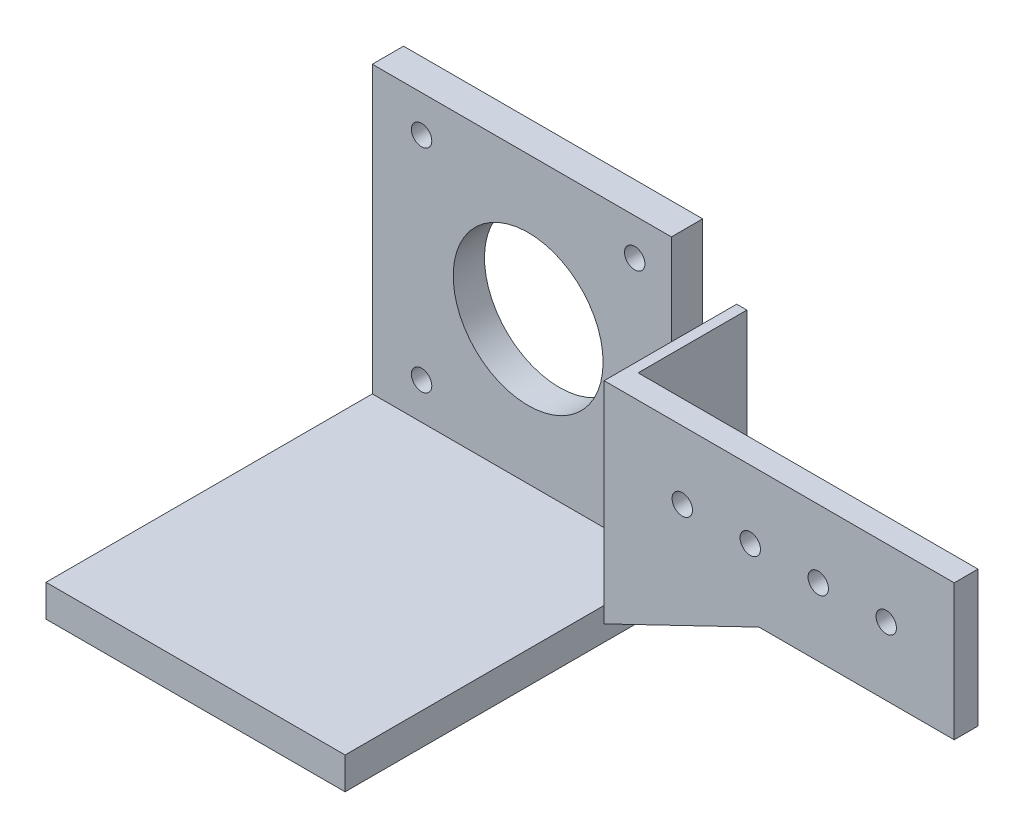
ISO-10303-21;
HEADER;
FILE_DESCRIPTION(('STEP AP214'),'2;1');
FILE_NAME('part.step','',(''),(''),'','','');
FILE_SCHEMA(('AUTOMOTIVE_DESIGN { 1 0 10303 214 1 1 1 1 }'));
ENDSEC;
DATA;
#1=APPLICATION_CONTEXT('core data for automotive mechanical design processes');
#2=APPLICATION_PROTOCOL_DEFINITION('international standard','automotive_design',2000,#1);
#3=PRODUCT_CONTEXT('',#1,'mechanical');
#4=PRODUCT('Part','Part','',(#3));
#5=PRODUCT_RELATED_PRODUCT_CATEGORY('part','',(#4));
#6=PRODUCT_DEFINITION_FORMATION('','',#4);
#7=PRODUCT_DEFINITION_CONTEXT('part definition',#1,'design');
#8=PRODUCT_DEFINITION('design','',#6,#7);
#9=PRODUCT_DEFINITION_SHAPE('','',#8);
#10=(LENGTH_UNIT() NAMED_UNIT(*) SI_UNIT(.MILLI.,.METRE.));
#11=(NAMED_UNIT(*) PLANE_ANGLE_UNIT() SI_UNIT($,.RADIAN.));
#12=(NAMED_UNIT(*) SI_UNIT($,.STERADIAN.) SOLID_ANGLE_UNIT());
#13=UNCERTAINTY_MEASURE_WITH_UNIT(LENGTH_MEASURE(1.E-05),#10,'distance_accuracy_value','');
#14=(GEOMETRIC_REPRESENTATION_CONTEXT(3) GLOBAL_UNCERTAINTY_ASSIGNED_CONTEXT((#13)) GLOBAL_UNIT_ASSIGNED_CONTEXT((#10,
#11,#12)) REPRESENTATION_CONTEXT('',''));
#15=CARTESIAN_POINT('',(0.,0.,0.));
#16=DIRECTION('',(0.,0.,1.));
#17=DIRECTION('',(1.,0.,0.));
#18=AXIS2_PLACEMENT_3D('',#15,#16,#17);
#19=CARTESIAN_POINT('',(-26.5,-9.96277968686154,3.5));
#20=DIRECTION('',(0.,1.,0.));
#21=DIRECTION('',(0.,0.,1.));
#22=AXIS2_PLACEMENT_3D('',#19,#20,#21);
#23=PLANE('',#22);
#24=DIRECTION('',(-1.,0.,0.));
#25=VECTOR('',#24,1.);
#26=CARTESIAN_POINT('',(-9.43146945186442,-9.96277968686154,-11.));
#27=LINE('',#26,#25);
#28=CARTESIAN_POINT('',(-25.,-9.96277968686154,-11.));
#29=VERTEX_POINT('',#28);
#30=CARTESIAN_POINT('',(-26.5,-9.96277968686154,-11.));
#31=VERTEX_POINT('',#30);
#32=EDGE_CURVE('E174',#29,#31,#27,.T.);
#33=ORIENTED_EDGE('',*,*,#32,.T.);
#34=DIRECTION('',(0.,0.,1.));
#35=VECTOR('',#34,1.);
#36=CARTESIAN_POINT('',(-26.5,-9.96277968686154,3.5));
#37=LINE('',#36,#35);
#38=CARTESIAN_POINT('',(-26.5,-9.96277968686154,-16.));
#39=VERTEX_POINT('',#38);
#40=EDGE_CURVE('E289',#39,#31,#37,.T.);
#41=ORIENTED_EDGE('',*,*,#40,.F.);
#42=DIRECTION('',(1.,0.,0.));
#43=VECTOR('',#42,1.);
#44=CARTESIAN_POINT('',(-26.5,-9.96277968686154,-16.));
#45=LINE('',#44,#43);
#46=CARTESIAN_POINT('',(-25.,-9.96277968686154,-16.));
#47=VERTEX_POINT('',#46);
#48=EDGE_CURVE('E292',#39,#47,#45,.T.);
#49=ORIENTED_EDGE('',*,*,#48,.T.);
#50=DIRECTION('',(0.,0.,1.));
#51=VECTOR('',#50,1.);
#52=CARTESIAN_POINT('',(-25.,-9.96277968686154,3.5));
#53=LINE('',#52,#51);
#54=EDGE_CURVE('E47',#47,#29,#53,.T.);
#55=ORIENTED_EDGE('',*,*,#54,.T.);
#56=EDGE_LOOP('',(#33,#41,#49,#55));
#57=FACE_BOUND('',#56,.T.);
#58=ADVANCED_FACE('F32',(#57),#23,.F.);
#59=CARTESIAN_POINT('',(-26.5,0.,0.));
#60=DIRECTION('',(-1.,0.,0.));
#61=DIRECTION('',(0.,0.,1.));
#62=AXIS2_PLACEMENT_3D('',#59,#60,#61);
#63=PLANE('',#62);
#64=DIRECTION('',(0.,0.,-1.));
#65=VECTOR('',#64,1.);
#66=CARTESIAN_POINT('',(-26.5,-20.98,-11.));
#67=LINE('',#66,#65);
#68=CARTESIAN_POINT('',(-26.5,-20.98,0.));
#69=VERTEX_POINT('',#68);
#70=CARTESIAN_POINT('',(-26.5,-20.98,-11.));
#71=VERTEX_POINT('',#70);
#72=EDGE_CURVE('E184',#69,#71,#67,.T.);
#73=ORIENTED_EDGE('',*,*,#72,.F.);
#74=DIRECTION('',(0.,0.,1.));
#75=VECTOR('',#74,1.);
#76=CARTESIAN_POINT('',(-26.5,-20.98,-35.3532115454882));
#77=LINE('',#76,#75);
#78=CARTESIAN_POINT('',(-26.5,-20.98,3.5));
#79=VERTEX_POINT('',#78);
#80=EDGE_CURVE('E205',#69,#79,#77,.T.);
#81=ORIENTED_EDGE('',*,*,#80,.T.);
#82=DIRECTION('',(0.,-1.,0.));
#83=VECTOR('',#82,1.);
#84=CARTESIAN_POINT('',(-26.5,0.,3.5));
#85=LINE('',#84,#83);
#86=CARTESIAN_POINT('',(-26.5,-18.63,3.5));
#87=VERTEX_POINT('',#86);
#88=EDGE_CURVE('E11',#87,#79,#85,.T.);
#89=ORIENTED_EDGE('',*,*,#88,.F.);
#90=DIRECTION('',(0.,0.,-1.));
#91=VECTOR('',#90,1.);
#92=CARTESIAN_POINT('',(-26.5,-18.63,41.6));
#93=LINE('',#92,#91);
#94=CARTESIAN_POINT('',(-26.5,-18.63,41.6));
#95=VERTEX_POINT('',#94);
#96=EDGE_CURVE('E246',#95,#87,#93,.T.);
#97=ORIENTED_EDGE('',*,*,#96,.F.);
#98=DIRECTION('',(0.,1.,0.));
#99=VECTOR('',#98,1.);
#100=CARTESIAN_POINT('',(-26.5,-23.33,41.6));
#101=LINE('',#100,#99);
#102=CARTESIAN_POINT('',(-26.5,-23.33,41.6));
#103=VERTEX_POINT('',#102);
#104=EDGE_CURVE('E236',#103,#95,#101,.T.);
#105=ORIENTED_EDGE('',*,*,#104,.F.);
#106=DIRECTION('',(0.,0.,1.));
#107=VECTOR('',#106,1.);
#108=CARTESIAN_POINT('',(-26.5,-23.33,-11.));
#109=LINE('',#108,#107);
#110=CARTESIAN_POINT('',(-26.5,-23.33,-11.));
#111=VERTEX_POINT('',#110);
#112=EDGE_CURVE('E252',#111,#103,#109,.T.);
#113=ORIENTED_EDGE('',*,*,#112,.F.);
#114=DIRECTION('',(0.,-1.,0.));
#115=VECTOR('',#114,1.);
#116=CARTESIAN_POINT('',(-26.5,23.37,-11.));
#117=LINE('',#116,#115);
#118=EDGE_CURVE('E55',#71,#111,#117,.T.);
#119=ORIENTED_EDGE('',*,*,#118,.F.);
#120=EDGE_LOOP('',(#73,#81,#89,#97,#105,#113,#119));
#121=FACE_BOUND('',#120,.T.);
#122=ADVANCED_FACE('F396',(#121),#63,.F.);
#123=CARTESIAN_POINT('',(-78.5,-23.33,-11.));
#124=DIRECTION('',(0.,1.,0.));
#125=DIRECTION('',(0.,0.,1.));
#126=AXIS2_PLACEMENT_3D('',#123,#124,#125);
#127=PLANE('',#126);
#128=DIRECTION('',(0.,0.,1.));
#129=VECTOR('',#128,1.);
#130=CARTESIAN_POINT('',(-70.5,-23.33,-11.));
#131=LINE('',#130,#129);
#132=CARTESIAN_POINT('',(-70.5,-23.33,-11.));
#133=VERTEX_POINT('',#132);
#134=CARTESIAN_POINT('',(-70.5,-23.33,41.6));
#135=VERTEX_POINT('',#134);
#136=EDGE_CURVE('E216',#133,#135,#131,.T.);
#137=ORIENTED_EDGE('',*,*,#136,.F.);
#138=DIRECTION('',(1.,0.,0.));
#139=VECTOR('',#138,1.);
#140=CARTESIAN_POINT('',(-78.5,-23.33,-11.));
#141=LINE('',#140,#139);
#142=EDGE_CURVE('E269',#133,#111,#141,.T.);
#143=ORIENTED_EDGE('',*,*,#142,.T.);
#144=ORIENTED_EDGE('',*,*,#112,.T.);
#145=DIRECTION('',(1.,0.,0.));
#146=VECTOR('',#145,1.);
#147=CARTESIAN_POINT('',(-78.5,-23.33,41.6));
#148=LINE('',#147,#146);
#149=EDGE_CURVE('E234',#135,#103,#148,.T.);
#150=ORIENTED_EDGE('',*,*,#149,.F.);
#151=EDGE_LOOP('',(#137,#143,#144,#150));
#152=FACE_BOUND('',#151,.T.);
#153=ADVANCED_FACE('F393',(#152),#127,.F.);
#154=CARTESIAN_POINT('',(-78.5,-18.63,41.6));
#155=DIRECTION('',(0.,-1.,0.));
#156=DIRECTION('',(0.,0.,-1.));
#157=AXIS2_PLACEMENT_3D('',#154,#155,#156);
#158=PLANE('',#157);
#159=DIRECTION('',(0.,0.,-1.));
#160=VECTOR('',#159,1.);
#161=CARTESIAN_POINT('',(-70.5,-18.63,41.6));
#162=LINE('',#161,#160);
#163=CARTESIAN_POINT('',(-70.5,-18.63,41.6));
#164=VERTEX_POINT('',#163);
#165=CARTESIAN_POINT('',(-70.5,-18.63,-6.4));
#166=VERTEX_POINT('',#165);
#167=EDGE_CURVE('E213',#164,#166,#162,.T.);
#168=ORIENTED_EDGE('',*,*,#167,.F.);
#169=DIRECTION('',(-1.,0.,0.));
#170=VECTOR('',#169,1.);
#171=CARTESIAN_POINT('',(-78.5,-18.63,41.6));
#172=LINE('',#171,#170);
#173=EDGE_CURVE('E239',#95,#164,#172,.T.);
#174=ORIENTED_EDGE('',*,*,#173,.F.);
#175=ORIENTED_EDGE('',*,*,#96,.T.);
#176=CARTESIAN_POINT('',(-26.5,-18.63,-6.4));
#177=VERTEX_POINT('',#176);
#178=EDGE_CURVE('E242',#87,#177,#93,.T.);
#179=ORIENTED_EDGE('',*,*,#178,.T.);
#180=DIRECTION('',(-1.,0.,0.));
#181=VECTOR('',#180,1.);
#182=CARTESIAN_POINT('',(-78.5,-18.63,-6.4));
#183=LINE('',#182,#181);
#184=EDGE_CURVE('E237',#177,#166,#183,.T.);
#185=ORIENTED_EDGE('',*,*,#184,.T.);
#186=EDGE_LOOP('',(#168,#174,#175,#179,#185));
#187=FACE_BOUND('',#186,.T.);
#188=ADVANCED_FACE('F401',(#187),#158,.F.);
#189=CARTESIAN_POINT('',(0.,0.,41.6));
#190=DIRECTION('',(0.,0.,-1.));
#191=DIRECTION('',(-1.,0.,0.));
#192=AXIS2_PLACEMENT_3D('',#189,#190,#191);
#193=PLANE('',#192);
#194=DIRECTION('',(0.,1.,0.));
#195=VECTOR('',#194,1.);
#196=CARTESIAN_POINT('',(-70.5,0.,41.6));
#197=LINE('',#196,#195);
#198=EDGE_CURVE('E361',#135,#164,#197,.T.);
#199=ORIENTED_EDGE('',*,*,#198,.F.);
#200=ORIENTED_EDGE('',*,*,#149,.T.);
#201=ORIENTED_EDGE('',*,*,#104,.T.);
#202=ORIENTED_EDGE('',*,*,#173,.T.);
#203=EDGE_LOOP('',(#199,#200,#201,#202));
#204=FACE_BOUND('',#203,.T.);
#205=ADVANCED_FACE('F391',(#204),#193,.F.);
#206=CARTESIAN_POINT('',(-78.5,23.37,-6.4));
#207=DIRECTION('',(0.,0.,-1.));
#208=DIRECTION('',(0.,1.,0.));
#209=AXIS2_PLACEMENT_3D('',#206,#207,#208);
#210=PLANE('',#209);
#211=DIRECTION('',(1.,0.,0.));
#212=VECTOR('',#211,1.);
#213=CARTESIAN_POINT('',(-78.5,23.37,-6.4));
#214=LINE('',#213,#212);
#215=CARTESIAN_POINT('',(-70.5,23.37,-6.4));
#216=VERTEX_POINT('',#215);
#217=CARTESIAN_POINT('',(-26.5,23.37,-6.4));
#218=VERTEX_POINT('',#217);
#219=EDGE_CURVE('E267',#216,#218,#214,.T.);
#220=ORIENTED_EDGE('',*,*,#219,.F.);
#221=DIRECTION('',(0.,1.,0.));
#222=VECTOR('',#221,1.);
#223=CARTESIAN_POINT('',(-70.5,23.37,-6.4));
#224=LINE('',#223,#222);
#225=EDGE_CURVE('E208',#166,#216,#224,.T.);
#226=ORIENTED_EDGE('',*,*,#225,.F.);
#227=ORIENTED_EDGE('',*,*,#184,.F.);
#228=DIRECTION('',(0.,1.,0.));
#229=VECTOR('',#228,1.);
#230=CARTESIAN_POINT('',(-26.5,23.37,-6.4));
#231=LINE('',#230,#229);
#232=CARTESIAN_POINT('',(-26.5,-1.30356694547265,-6.4));
#233=VERTEX_POINT('',#232);
#234=EDGE_CURVE('E403',#177,#233,#231,.T.);
#235=ORIENTED_EDGE('',*,*,#234,.T.);
#236=CARTESIAN_POINT('',(-26.5,2.29643305452735,-6.4));
#237=VERTEX_POINT('',#236);
#238=EDGE_CURVE('E260',#233,#237,#231,.T.);
#239=ORIENTED_EDGE('',*,*,#238,.T.);
#240=CARTESIAN_POINT('',(-26.5,10.,-6.4));
#241=VERTEX_POINT('',#240);
#242=EDGE_CURVE('E261',#237,#241,#231,.T.);
#243=ORIENTED_EDGE('',*,*,#242,.T.);
#244=EDGE_CURVE('E257',#241,#218,#231,.T.);
#245=ORIENTED_EDGE('',*,*,#244,.T.);
#246=EDGE_LOOP('',(#220,#226,#227,#235,#239,#243,#245));
#247=FACE_BOUND('',#246,.T.);
#248=CARTESIAN_POINT('',(-31.9,-13.23,-6.4));
#249=DIRECTION('',(0.,0.,1.));
#250=DIRECTION('',(1.,0.,0.));
#251=AXIS2_PLACEMENT_3D('',#248,#249,#250);
#252=CIRCLE('',#251,1.5);
#253=CARTESIAN_POINT('',(-30.4,-13.23,-6.4));
#254=VERTEX_POINT('',#253);
#255=EDGE_CURVE('E228',#254,#254,#252,.T.);
#256=ORIENTED_EDGE('',*,*,#255,.F.);
#257=EDGE_LOOP('',(#256));
#258=FACE_BOUND('',#257,.T.);
#259=CARTESIAN_POINT('',(-47.575,2.37,-6.4));
#260=DIRECTION('',(0.,0.,1.));
#261=DIRECTION('',(1.,0.,0.));
#262=AXIS2_PLACEMENT_3D('',#259,#260,#261);
#263=CIRCLE('',#262,11.025);
#264=CARTESIAN_POINT('',(-36.55,2.37,-6.4));
#265=VERTEX_POINT('',#264);
#266=EDGE_CURVE('E218',#265,#265,#263,.T.);
#267=ORIENTED_EDGE('',*,*,#266,.F.);
#268=EDGE_LOOP('',(#267));
#269=FACE_BOUND('',#268,.T.);
#270=CARTESIAN_POINT('',(-63.25,17.97,-6.4));
#271=DIRECTION('',(0.,0.,1.));
#272=DIRECTION('',(1.,0.,0.));
#273=AXIS2_PLACEMENT_3D('',#270,#271,#272);
#274=CIRCLE('',#273,1.50000000000001);
#275=CARTESIAN_POINT('',(-61.75,17.97,-6.4));
#276=VERTEX_POINT('',#275);
#277=EDGE_CURVE('E219',#276,#276,#274,.T.);
#278=ORIENTED_EDGE('',*,*,#277,.F.);
#279=EDGE_LOOP('',(#278));
#280=FACE_BOUND('',#279,.T.);
#281=CARTESIAN_POINT('',(-31.9,17.97,-6.4));
#282=DIRECTION('',(0.,0.,1.));
#283=DIRECTION('',(-1.,0.,0.));
#284=AXIS2_PLACEMENT_3D('',#281,#282,#283);
#285=CIRCLE('',#284,1.5);
#286=CARTESIAN_POINT('',(-33.4,17.97,-6.4));
#287=VERTEX_POINT('',#286);
#288=EDGE_CURVE('E222',#287,#287,#285,.T.);
#289=ORIENTED_EDGE('',*,*,#288,.F.);
#290=EDGE_LOOP('',(#289));
#291=FACE_BOUND('',#290,.T.);
#292=CARTESIAN_POINT('',(-63.25,-13.23,-6.4));
#293=DIRECTION('',(0.,0.,1.));
#294=DIRECTION('',(-1.,0.,0.));
#295=AXIS2_PLACEMENT_3D('',#292,#293,#294);
#296=CIRCLE('',#295,1.50000000000001);
#297=CARTESIAN_POINT('',(-64.75,-13.23,-6.4));
#298=VERTEX_POINT('',#297);
#299=EDGE_CURVE('E225',#298,#298,#296,.T.);
#300=ORIENTED_EDGE('',*,*,#299,.F.);
#301=EDGE_LOOP('',(#300));
#302=FACE_BOUND('',#301,.T.);
#303=ADVANCED_FACE('F371',(#247,#258,#269,#280,#291,#302),#210,.F.);
#304=CARTESIAN_POINT('',(-26.5,0.,0.));
#305=DIRECTION('',(1.,0.,0.));
#306=DIRECTION('',(0.,0.,-1.));
#307=AXIS2_PLACEMENT_3D('',#304,#305,#306);
#308=PLANE('',#307);
#309=CARTESIAN_POINT('',(-26.5,10.,-11.));
#310=VERTEX_POINT('',#309);
#311=CARTESIAN_POINT('',(-26.5,2.53604085996446,-11.));
#312=VERTEX_POINT('',#311);
#313=EDGE_CURVE('E362',#310,#312,#117,.T.);
#314=ORIENTED_EDGE('',*,*,#313,.F.);
#315=DIRECTION('',(0.,0.,-1.));
#316=VECTOR('',#315,1.);
#317=CARTESIAN_POINT('',(-26.5,10.,3.5));
#318=LINE('',#317,#316);
#319=CARTESIAN_POINT('',(-26.5,9.99999999999999,-16.));
#320=VERTEX_POINT('',#319);
#321=EDGE_CURVE('E283',#310,#320,#318,.T.);
#322=ORIENTED_EDGE('',*,*,#321,.T.);
#323=DIRECTION('',(0.,-1.,0.));
#324=VECTOR('',#323,1.);
#325=CARTESIAN_POINT('',(-26.5,9.99999999999999,-16.));
#326=LINE('',#325,#324);
#327=EDGE_CURVE('E286',#320,#39,#326,.T.);
#328=ORIENTED_EDGE('',*,*,#327,.T.);
#329=ORIENTED_EDGE('',*,*,#40,.T.);
#330=CARTESIAN_POINT('',(-26.5,-1.54317475090976,-11.));
#331=VERTEX_POINT('',#330);
#332=EDGE_CURVE('E254',#331,#31,#117,.T.);
#333=ORIENTED_EDGE('',*,*,#332,.F.);
#334=CARTESIAN_POINT('',(-26.5,0.49643305452735,-8.8));
#335=DIRECTION('',(-1.,0.,0.));
#336=DIRECTION('',(0.,0.,1.));
#337=AXIS2_PLACEMENT_3D('',#334,#335,#336);
#338=CIRCLE('',#337,3.);
#339=EDGE_CURVE('E280',#312,#331,#338,.T.);
#340=ORIENTED_EDGE('',*,*,#339,.F.);
#341=EDGE_LOOP('',(#314,#322,#328,#329,#333,#340));
#342=FACE_BOUND('',#341,.T.);
#343=ADVANCED_FACE('F424',(#342),#308,.F.);
#344=DIRECTION('',(0.,1.,0.));
#345=VECTOR('',#344,1.);
#346=CARTESIAN_POINT('',(-26.5,10.,3.5));
#347=LINE('',#346,#345);
#348=CARTESIAN_POINT('',(-26.5,10.,3.5));
#349=VERTEX_POINT('',#348);
#350=EDGE_CURVE('E281',#87,#349,#347,.T.);
#351=ORIENTED_EDGE('',*,*,#350,.T.);
#352=EDGE_CURVE('E284',#349,#241,#318,.T.);
#353=ORIENTED_EDGE('',*,*,#352,.T.);
#354=ORIENTED_EDGE('',*,*,#242,.F.);
#355=EDGE_CURVE('E272',#233,#237,#338,.T.);
#356=ORIENTED_EDGE('',*,*,#355,.F.);
#357=ORIENTED_EDGE('',*,*,#234,.F.);
#358=ORIENTED_EDGE('',*,*,#178,.F.);
#359=EDGE_LOOP('',(#351,#353,#354,#356,#357,#358));
#360=FACE_BOUND('',#359,.T.);
#361=ADVANCED_FACE('F417',(#360),#308,.F.);
#362=CARTESIAN_POINT('',(0.,0.,3.5));
#363=DIRECTION('',(0.,0.,1.));
#364=DIRECTION('',(1.,0.,0.));
#365=AXIS2_PLACEMENT_3D('',#362,#363,#364);
#366=PLANE('',#365);
#367=DIRECTION('',(0.90086472354025,0.43409993075414,0.));
#368=VECTOR('',#367,1.);
#369=CARTESIAN_POINT('',(5.34846114518622,-5.6331733161671,3.5));
#370=LINE('',#369,#368);
#371=CARTESIAN_POINT('',(-3.71378428398285,-10.,3.5));
#372=VERTEX_POINT('',#371);
#373=EDGE_CURVE('E177',#79,#372,#370,.T.);
#374=ORIENTED_EDGE('',*,*,#373,.T.);
#375=DIRECTION('',(1.,0.,0.));
#376=VECTOR('',#375,1.);
#377=CARTESIAN_POINT('',(-25.,-10.,3.5));
#378=LINE('',#377,#376);
#379=CARTESIAN_POINT('',(25.,-10.,3.5));
#380=VERTEX_POINT('',#379);
#381=EDGE_CURVE('E333',#372,#380,#378,.T.);
#382=ORIENTED_EDGE('',*,*,#381,.T.);
#383=DIRECTION('',(0.,1.,0.));
#384=VECTOR('',#383,1.);
#385=CARTESIAN_POINT('',(25.,10.,3.5));
#386=LINE('',#385,#384);
#387=CARTESIAN_POINT('',(25.,10.,3.5));
#388=VERTEX_POINT('',#387);
#389=EDGE_CURVE('E326',#380,#388,#386,.T.);
#390=ORIENTED_EDGE('',*,*,#389,.T.);
#391=DIRECTION('',(-1.,0.,0.));
#392=VECTOR('',#391,1.);
#393=CARTESIAN_POINT('',(-25.,10.,3.5));
#394=LINE('',#393,#392);
#395=EDGE_CURVE('E329',#388,#349,#394,.T.);
#396=ORIENTED_EDGE('',*,*,#395,.T.);
#397=ORIENTED_EDGE('',*,*,#350,.F.);
#398=ORIENTED_EDGE('',*,*,#88,.T.);
#399=EDGE_LOOP('',(#374,#382,#390,#396,#397,#398));
#400=FACE_BOUND('',#399,.T.);
#401=CARTESIAN_POINT('',(5.,0.,3.5));
#402=DIRECTION('',(0.,0.,1.));
#403=DIRECTION('',(1.,0.,0.));
#404=AXIS2_PLACEMENT_3D('',#401,#402,#403);
#405=CIRCLE('',#404,1.5);
#406=CARTESIAN_POINT('',(6.5,0.,3.5));
#407=VERTEX_POINT('',#406);
#408=EDGE_CURVE('E308',#407,#407,#405,.T.);
#409=ORIENTED_EDGE('',*,*,#408,.F.);
#410=EDGE_LOOP('',(#409));
#411=FACE_BOUND('',#410,.T.);
#412=CARTESIAN_POINT('',(-15.,0.,3.5));
#413=DIRECTION('',(0.,0.,1.));
#414=DIRECTION('',(1.,0.,0.));
#415=AXIS2_PLACEMENT_3D('',#412,#413,#414);
#416=CIRCLE('',#415,1.5);
#417=CARTESIAN_POINT('',(-13.5,0.,3.5));
#418=VERTEX_POINT('',#417);
#419=EDGE_CURVE('E320',#418,#418,#416,.T.);
#420=ORIENTED_EDGE('',*,*,#419,.F.);
#421=EDGE_LOOP('',(#420));
#422=FACE_BOUND('',#421,.T.);
#423=CARTESIAN_POINT('',(-5.,0.,3.5));
#424=DIRECTION('',(0.,0.,1.));
#425=DIRECTION('',(1.,0.,0.));
#426=AXIS2_PLACEMENT_3D('',#423,#424,#425);
#427=CIRCLE('',#426,1.5);
#428=CARTESIAN_POINT('',(-3.5,0.,3.5));
#429=VERTEX_POINT('',#428);
#430=EDGE_CURVE('E314',#429,#429,#427,.T.);
#431=ORIENTED_EDGE('',*,*,#430,.F.);
#432=EDGE_LOOP('',(#431));
#433=FACE_BOUND('',#432,.T.);
#434=CARTESIAN_POINT('',(15.,0.,3.5));
#435=DIRECTION('',(0.,0.,1.));
#436=DIRECTION('',(1.,0.,0.));
#437=AXIS2_PLACEMENT_3D('',#434,#435,#436);
#438=CIRCLE('',#437,1.5);
#439=CARTESIAN_POINT('',(16.5,0.,3.5));
#440=VERTEX_POINT('',#439);
#441=EDGE_CURVE('E302',#440,#440,#438,.T.);
#442=ORIENTED_EDGE('',*,*,#441,.F.);
#443=EDGE_LOOP('',(#442));
#444=FACE_BOUND('',#443,.T.);
#445=ADVANCED_FACE('F459',(#400,#411,#422,#433,#444),#366,.T.);
#446=CARTESIAN_POINT('',(0.,0.,0.));
#447=DIRECTION('',(0.,0.,1.));
#448=DIRECTION('',(1.,0.,0.));
#449=AXIS2_PLACEMENT_3D('',#446,#447,#448);
#450=PLANE('',#449);
#451=DIRECTION('',(-0.90086472354025,-0.43409993075414,0.));
#452=VECTOR('',#451,1.);
#453=CARTESIAN_POINT('',(5.34846114518622,-5.6331733161671,0.));
#454=LINE('',#453,#452);
#455=CARTESIAN_POINT('',(-3.71378428398285,-10.,0.));
#456=VERTEX_POINT('',#455);
#457=CARTESIAN_POINT('',(-25.,-20.2571945896912,0.));
#458=VERTEX_POINT('',#457);
#459=EDGE_CURVE('E198',#456,#458,#454,.T.);
#460=ORIENTED_EDGE('',*,*,#459,.T.);
#461=DIRECTION('',(0.,-1.,0.));
#462=VECTOR('',#461,1.);
#463=CARTESIAN_POINT('',(-25.,10.,0.));
#464=LINE('',#463,#462);
#465=CARTESIAN_POINT('',(-25.,10.,0.));
#466=VERTEX_POINT('',#465);
#467=EDGE_CURVE('E340',#466,#458,#464,.T.);
#468=ORIENTED_EDGE('',*,*,#467,.F.);
#469=DIRECTION('',(-1.,0.,0.));
#470=VECTOR('',#469,1.);
#471=CARTESIAN_POINT('',(-25.,10.,0.));
#472=LINE('',#471,#470);
#473=CARTESIAN_POINT('',(25.,10.,0.));
#474=VERTEX_POINT('',#473);
#475=EDGE_CURVE('E338',#474,#466,#472,.T.);
#476=ORIENTED_EDGE('',*,*,#475,.F.);
#477=DIRECTION('',(0.,1.,0.));
#478=VECTOR('',#477,1.);
#479=CARTESIAN_POINT('',(25.,10.,0.));
#480=LINE('',#479,#478);
#481=CARTESIAN_POINT('',(25.,-10.,0.));
#482=VERTEX_POINT('',#481);
#483=EDGE_CURVE('E323',#482,#474,#480,.T.);
#484=ORIENTED_EDGE('',*,*,#483,.F.);
#485=DIRECTION('',(1.,0.,0.));
#486=VECTOR('',#485,1.);
#487=CARTESIAN_POINT('',(-25.,-10.,0.));
#488=LINE('',#487,#486);
#489=EDGE_CURVE('E330',#456,#482,#488,.T.);
#490=ORIENTED_EDGE('',*,*,#489,.F.);
#491=EDGE_LOOP('',(#460,#468,#476,#484,#490));
#492=FACE_BOUND('',#491,.T.);
#493=CARTESIAN_POINT('',(-15.,0.,0.));
#494=DIRECTION('',(0.,0.,1.));
#495=DIRECTION('',(1.,0.,0.));
#496=AXIS2_PLACEMENT_3D('',#493,#494,#495);
#497=CIRCLE('',#496,1.5);
#498=CARTESIAN_POINT('',(-13.5,0.,0.));
#499=VERTEX_POINT('',#498);
#500=EDGE_CURVE('E317',#499,#499,#497,.T.);
#501=ORIENTED_EDGE('',*,*,#500,.T.);
#502=EDGE_LOOP('',(#501));
#503=FACE_BOUND('',#502,.T.);
#504=CARTESIAN_POINT('',(-5.,0.,0.));
#505=DIRECTION('',(0.,0.,1.));
#506=DIRECTION('',(1.,0.,0.));
#507=AXIS2_PLACEMENT_3D('',#504,#505,#506);
#508=CIRCLE('',#507,1.5);
#509=CARTESIAN_POINT('',(-3.5,0.,0.));
#510=VERTEX_POINT('',#509);
#511=EDGE_CURVE('E311',#510,#510,#508,.T.);
#512=ORIENTED_EDGE('',*,*,#511,.T.);
#513=EDGE_LOOP('',(#512));
#514=FACE_BOUND('',#513,.T.);
#515=CARTESIAN_POINT('',(5.,0.,0.));
#516=DIRECTION('',(0.,0.,1.));
#517=DIRECTION('',(1.,0.,0.));
#518=AXIS2_PLACEMENT_3D('',#515,#516,#517);
#519=CIRCLE('',#518,1.5);
#520=CARTESIAN_POINT('',(6.5,0.,0.));
#521=VERTEX_POINT('',#520);
#522=EDGE_CURVE('E305',#521,#521,#519,.T.);
#523=ORIENTED_EDGE('',*,*,#522,.T.);
#524=EDGE_LOOP('',(#523));
#525=FACE_BOUND('',#524,.T.);
#526=CARTESIAN_POINT('',(15.,0.,0.));
#527=DIRECTION('',(0.,0.,1.));
#528=DIRECTION('',(1.,0.,0.));
#529=AXIS2_PLACEMENT_3D('',#526,#527,#528);
#530=CIRCLE('',#529,1.5);
#531=CARTESIAN_POINT('',(16.5,0.,0.));
#532=VERTEX_POINT('',#531);
#533=EDGE_CURVE('E301',#532,#532,#530,.T.);
#534=ORIENTED_EDGE('',*,*,#533,.T.);
#535=EDGE_LOOP('',(#534));
#536=FACE_BOUND('',#535,.T.);
#537=ADVANCED_FACE('F462',(#492,#503,#514,#525,#536),#450,.F.);
#538=CARTESIAN_POINT('',(25.,10.,3.5));
#539=DIRECTION('',(-1.,0.,0.));
#540=DIRECTION('',(0.,-1.,0.));
#541=AXIS2_PLACEMENT_3D('',#538,#539,#540);
#542=PLANE('',#541);
#543=ORIENTED_EDGE('',*,*,#483,.T.);
#544=DIRECTION('',(0.,0.,-1.));
#545=VECTOR('',#544,1.);
#546=CARTESIAN_POINT('',(25.,10.,3.5));
#547=LINE('',#546,#545);
#548=EDGE_CURVE('E345',#388,#474,#547,.T.);
#549=ORIENTED_EDGE('',*,*,#548,.F.);
#550=ORIENTED_EDGE('',*,*,#389,.F.);
#551=DIRECTION('',(0.,0.,-1.));
#552=VECTOR('',#551,1.);
#553=CARTESIAN_POINT('',(25.,-10.,3.5));
#554=LINE('',#553,#552);
#555=EDGE_CURVE('E335',#380,#482,#554,.T.);
#556=ORIENTED_EDGE('',*,*,#555,.T.);
#557=EDGE_LOOP('',(#543,#549,#550,#556));
#558=FACE_BOUND('',#557,.T.);
#559=ADVANCED_FACE('F34',(#558),#542,.F.);
#560=CARTESIAN_POINT('',(-25.,10.,3.5));
#561=DIRECTION('',(0.,-1.,0.));
#562=DIRECTION('',(0.,0.,-1.));
#563=AXIS2_PLACEMENT_3D('',#560,#561,#562);
#564=PLANE('',#563);
#565=ORIENTED_EDGE('',*,*,#475,.T.);
#566=DIRECTION('',(0.,0.,-1.));
#567=VECTOR('',#566,1.);
#568=CARTESIAN_POINT('',(-25.,10.,3.5));
#569=LINE('',#568,#567);
#570=CARTESIAN_POINT('',(-25.,9.99999999999999,-16.));
#571=VERTEX_POINT('',#570);
#572=EDGE_CURVE('E276',#466,#571,#569,.T.);
#573=ORIENTED_EDGE('',*,*,#572,.T.);
#574=DIRECTION('',(1.,0.,0.));
#575=VECTOR('',#574,1.);
#576=CARTESIAN_POINT('',(-26.5,9.99999999999999,-16.));
#577=LINE('',#576,#575);
#578=EDGE_CURVE('E298',#320,#571,#577,.T.);
#579=ORIENTED_EDGE('',*,*,#578,.F.);
#580=ORIENTED_EDGE('',*,*,#321,.F.);
#581=EDGE_CURVE('E287',#241,#310,#318,.T.);
#582=ORIENTED_EDGE('',*,*,#581,.F.);
#583=ORIENTED_EDGE('',*,*,#352,.F.);
#584=ORIENTED_EDGE('',*,*,#395,.F.);
#585=ORIENTED_EDGE('',*,*,#548,.T.);
#586=EDGE_LOOP('',(#565,#573,#579,#580,#582,#583,#584,#585));
#587=FACE_BOUND('',#586,.T.);
#588=ADVANCED_FACE('F421',(#587),#564,.F.);
#589=CARTESIAN_POINT('',(-25.,-10.,3.5));
#590=DIRECTION('',(0.,1.,0.));
#591=DIRECTION('',(0.,0.,1.));
#592=AXIS2_PLACEMENT_3D('',#589,#590,#591);
#593=PLANE('',#592);
#594=ORIENTED_EDGE('',*,*,#381,.F.);
#595=DIRECTION('',(0.,0.,-1.));
#596=VECTOR('',#595,1.);
#597=CARTESIAN_POINT('',(-3.71378428398285,-10.,3.5));
#598=LINE('',#597,#596);
#599=EDGE_CURVE('E201',#372,#456,#598,.T.);
#600=ORIENTED_EDGE('',*,*,#599,.T.);
#601=ORIENTED_EDGE('',*,*,#489,.T.);
#602=ORIENTED_EDGE('',*,*,#555,.F.);
#603=EDGE_LOOP('',(#594,#600,#601,#602));
#604=FACE_BOUND('',#603,.T.);
#605=ADVANCED_FACE('F457',(#604),#593,.F.);
#606=CARTESIAN_POINT('',(-15.,0.,3.5));
#607=DIRECTION('',(0.,0.,-1.));
#608=DIRECTION('',(-1.,0.,0.));
#609=AXIS2_PLACEMENT_3D('',#606,#607,#608);
#610=CYLINDRICAL_SURFACE('',#609,1.5);
#611=ORIENTED_EDGE('',*,*,#419,.T.);
#612=EDGE_LOOP('',(#611));
#613=FACE_BOUND('',#612,.T.);
#614=ORIENTED_EDGE('',*,*,#500,.F.);
#615=EDGE_LOOP('',(#614));
#616=FACE_BOUND('',#615,.T.);
#617=ADVANCED_FACE('F453',(#613,#616),#610,.F.);
#618=CARTESIAN_POINT('',(-5.,0.,3.5));
#619=DIRECTION('',(0.,0.,-1.));
#620=DIRECTION('',(-1.,0.,0.));
#621=AXIS2_PLACEMENT_3D('',#618,#619,#620);
#622=CYLINDRICAL_SURFACE('',#621,1.5);
#623=ORIENTED_EDGE('',*,*,#430,.T.);
#624=EDGE_LOOP('',(#623));
#625=FACE_BOUND('',#624,.T.);
#626=ORIENTED_EDGE('',*,*,#511,.F.);
#627=EDGE_LOOP('',(#626));
#628=FACE_BOUND('',#627,.T.);
#629=ADVANCED_FACE('F449',(#625,#628),#622,.F.);
#630=CARTESIAN_POINT('',(5.,0.,3.5));
#631=DIRECTION('',(0.,0.,-1.));
#632=DIRECTION('',(-1.,0.,0.));
#633=AXIS2_PLACEMENT_3D('',#630,#631,#632);
#634=CYLINDRICAL_SURFACE('',#633,1.5);
#635=ORIENTED_EDGE('',*,*,#408,.T.);
#636=EDGE_LOOP('',(#635));
#637=FACE_BOUND('',#636,.T.);
#638=ORIENTED_EDGE('',*,*,#522,.F.);
#639=EDGE_LOOP('',(#638));
#640=FACE_BOUND('',#639,.T.);
#641=ADVANCED_FACE('F445',(#637,#640),#634,.F.);
#642=CARTESIAN_POINT('',(15.,0.,3.5));
#643=DIRECTION('',(0.,0.,-1.));
#644=DIRECTION('',(-1.,0.,0.));
#645=AXIS2_PLACEMENT_3D('',#642,#643,#644);
#646=CYLINDRICAL_SURFACE('',#645,1.5);
#647=ORIENTED_EDGE('',*,*,#441,.T.);
#648=EDGE_LOOP('',(#647));
#649=FACE_BOUND('',#648,.T.);
#650=ORIENTED_EDGE('',*,*,#533,.F.);
#651=EDGE_LOOP('',(#650));
#652=FACE_BOUND('',#651,.T.);
#653=ADVANCED_FACE('F442',(#649,#652),#646,.F.);
#654=CARTESIAN_POINT('',(-25.,0.,0.));
#655=DIRECTION('',(1.,0.,0.));
#656=DIRECTION('',(0.,0.,-1.));
#657=AXIS2_PLACEMENT_3D('',#654,#655,#656);
#658=PLANE('',#657);
#659=ORIENTED_EDGE('',*,*,#572,.F.);
#660=ORIENTED_EDGE('',*,*,#467,.T.);
#661=DIRECTION('',(0.,-1.,0.));
#662=VECTOR('',#661,1.);
#663=CARTESIAN_POINT('',(-25.,-20.98,0.));
#664=LINE('',#663,#662);
#665=CARTESIAN_POINT('',(-25.,-20.98,0.));
#666=VERTEX_POINT('',#665);
#667=EDGE_CURVE('E189',#458,#666,#664,.T.);
#668=ORIENTED_EDGE('',*,*,#667,.T.);
#669=DIRECTION('',(0.,0.,-1.));
#670=VECTOR('',#669,1.);
#671=CARTESIAN_POINT('',(-25.,-20.98,-11.));
#672=LINE('',#671,#670);
#673=CARTESIAN_POINT('',(-25.,-20.98,-11.));
#674=VERTEX_POINT('',#673);
#675=EDGE_CURVE('E178',#666,#674,#672,.T.);
#676=ORIENTED_EDGE('',*,*,#675,.T.);
#677=DIRECTION('',(0.,1.,0.));
#678=VECTOR('',#677,1.);
#679=CARTESIAN_POINT('',(-25.,-9.96277968686154,-11.));
#680=LINE('',#679,#678);
#681=EDGE_CURVE('E167',#674,#29,#680,.T.);
#682=ORIENTED_EDGE('',*,*,#681,.T.);
#683=ORIENTED_EDGE('',*,*,#54,.F.);
#684=DIRECTION('',(0.,-1.,0.));
#685=VECTOR('',#684,1.);
#686=CARTESIAN_POINT('',(-25.,9.99999999999999,-16.));
#687=LINE('',#686,#685);
#688=EDGE_CURVE('E294',#571,#47,#687,.T.);
#689=ORIENTED_EDGE('',*,*,#688,.F.);
#690=EDGE_LOOP('',(#659,#660,#668,#676,#682,#683,#689));
#691=FACE_BOUND('',#690,.T.);
#692=ADVANCED_FACE('F187',(#691),#658,.T.);
#693=CARTESIAN_POINT('',(-26.5,9.99999999999999,-16.));
#694=DIRECTION('',(0.,0.,1.));
#695=DIRECTION('',(0.,-1.,0.));
#696=AXIS2_PLACEMENT_3D('',#693,#694,#695);
#697=PLANE('',#696);
#698=ORIENTED_EDGE('',*,*,#688,.T.);
#699=ORIENTED_EDGE('',*,*,#48,.F.);
#700=ORIENTED_EDGE('',*,*,#327,.F.);
#701=ORIENTED_EDGE('',*,*,#578,.T.);
#702=EDGE_LOOP('',(#698,#699,#700,#701));
#703=FACE_BOUND('',#702,.T.);
#704=ADVANCED_FACE('F429',(#703),#697,.F.);
#705=CARTESIAN_POINT('',(-26.,0.49643305452735,-8.8));
#706=DIRECTION('',(-1.,0.,0.));
#707=DIRECTION('',(0.,0.,1.));
#708=AXIS2_PLACEMENT_3D('',#705,#706,#707);
#709=CYLINDRICAL_SURFACE('',#708,3.);
#710=CARTESIAN_POINT('',(-26.,0.49643305452735,-8.8));
#711=DIRECTION('',(-1.,0.,0.));
#712=DIRECTION('',(0.,0.,1.));
#713=AXIS2_PLACEMENT_3D('',#710,#711,#712);
#714=CIRCLE('',#713,3.);
#715=CARTESIAN_POINT('',(-26.,0.49643305452735,-5.8));
#716=VERTEX_POINT('',#715);
#717=EDGE_CURVE('E273',#716,#716,#714,.T.);
#718=ORIENTED_EDGE('',*,*,#717,.F.);
#719=EDGE_LOOP('',(#718));
#720=FACE_BOUND('',#719,.T.);
#721=EDGE_CURVE('E277',#237,#312,#338,.T.);
#722=ORIENTED_EDGE('',*,*,#721,.T.);
#723=ORIENTED_EDGE('',*,*,#339,.T.);
#724=EDGE_CURVE('E412',#331,#233,#338,.T.);
#725=ORIENTED_EDGE('',*,*,#724,.T.);
#726=ORIENTED_EDGE('',*,*,#355,.T.);
#727=EDGE_LOOP('',(#722,#723,#725,#726));
#728=FACE_BOUND('',#727,.T.);
#729=ADVANCED_FACE('F416',(#720,#728),#709,.F.);
#730=CARTESIAN_POINT('',(-26.,0.49643305452735,-8.8));
#731=DIRECTION('',(-1.,0.,0.));
#732=DIRECTION('',(0.,0.,1.));
#733=AXIS2_PLACEMENT_3D('',#730,#731,#732);
#734=PLANE('',#733);
#735=ORIENTED_EDGE('',*,*,#717,.T.);
#736=EDGE_LOOP('',(#735));
#737=FACE_BOUND('',#736,.T.);
#738=ADVANCED_FACE('F538',(#737),#734,.T.);
#739=ORIENTED_EDGE('',*,*,#244,.F.);
#740=ORIENTED_EDGE('',*,*,#581,.T.);
#741=CARTESIAN_POINT('',(-26.5,23.37,-11.));
#742=VERTEX_POINT('',#741);
#743=EDGE_CURVE('E249',#742,#310,#117,.T.);
#744=ORIENTED_EDGE('',*,*,#743,.F.);
#745=DIRECTION('',(0.,0.,-1.));
#746=VECTOR('',#745,1.);
#747=CARTESIAN_POINT('',(-26.5,23.37,-11.));
#748=LINE('',#747,#746);
#749=EDGE_CURVE('E262',#218,#742,#748,.T.);
#750=ORIENTED_EDGE('',*,*,#749,.F.);
#751=EDGE_LOOP('',(#739,#740,#744,#750));
#752=FACE_BOUND('',#751,.T.);
#753=ADVANCED_FACE('F381',(#752),#63,.F.);
#754=CARTESIAN_POINT('',(-78.5,23.37,-11.));
#755=DIRECTION('',(0.,0.,1.));
#756=DIRECTION('',(0.,-1.,0.));
#757=AXIS2_PLACEMENT_3D('',#754,#755,#756);
#758=PLANE('',#757);
#759=CARTESIAN_POINT('',(-63.25,-13.23,-11.));
#760=DIRECTION('',(0.,0.,1.));
#761=DIRECTION('',(0.,-1.,0.));
#762=AXIS2_PLACEMENT_3D('',#759,#760,#761);
#763=CIRCLE('',#762,1.50000000000001);
#764=CARTESIAN_POINT('',(-63.25,-14.73,-11.));
#765=VERTEX_POINT('',#764);
#766=EDGE_CURVE('E245',#765,#765,#763,.T.);
#767=ORIENTED_EDGE('',*,*,#766,.T.);
#768=EDGE_LOOP('',(#767));
#769=FACE_BOUND('',#768,.T.);
#770=CARTESIAN_POINT('',(-31.9,17.97,-11.));
#771=DIRECTION('',(0.,0.,1.));
#772=DIRECTION('',(0.,-1.,0.));
#773=AXIS2_PLACEMENT_3D('',#770,#771,#772);
#774=CIRCLE('',#773,1.5);
#775=CARTESIAN_POINT('',(-31.9,16.47,-11.));
#776=VERTEX_POINT('',#775);
#777=EDGE_CURVE('E356',#776,#776,#774,.T.);
#778=ORIENTED_EDGE('',*,*,#777,.T.);
#779=EDGE_LOOP('',(#778));
#780=FACE_BOUND('',#779,.T.);
#781=CARTESIAN_POINT('',(-63.25,17.97,-11.));
#782=DIRECTION('',(0.,0.,1.));
#783=DIRECTION('',(0.,-1.,0.));
#784=AXIS2_PLACEMENT_3D('',#781,#782,#783);
#785=CIRCLE('',#784,1.50000000000001);
#786=CARTESIAN_POINT('',(-63.25,16.47,-11.));
#787=VERTEX_POINT('',#786);
#788=EDGE_CURVE('E353',#787,#787,#785,.T.);
#789=ORIENTED_EDGE('',*,*,#788,.T.);
#790=EDGE_LOOP('',(#789));
#791=FACE_BOUND('',#790,.T.);
#792=CARTESIAN_POINT('',(-47.575,2.37,-11.));
#793=DIRECTION('',(0.,0.,1.));
#794=DIRECTION('',(0.,-1.,0.));
#795=AXIS2_PLACEMENT_3D('',#792,#793,#794);
#796=CIRCLE('',#795,11.025);
#797=CARTESIAN_POINT('',(-47.575,-8.655,-11.));
#798=VERTEX_POINT('',#797);
#799=EDGE_CURVE('E350',#798,#798,#796,.T.);
#800=ORIENTED_EDGE('',*,*,#799,.T.);
#801=EDGE_LOOP('',(#800));
#802=FACE_BOUND('',#801,.T.);
#803=CARTESIAN_POINT('',(-31.9,-13.23,-11.));
#804=DIRECTION('',(0.,0.,1.));
#805=DIRECTION('',(0.,-1.,0.));
#806=AXIS2_PLACEMENT_3D('',#803,#804,#805);
#807=CIRCLE('',#806,1.5);
#808=CARTESIAN_POINT('',(-31.9,-14.73,-11.));
#809=VERTEX_POINT('',#808);
#810=EDGE_CURVE('E233',#809,#809,#807,.T.);
#811=ORIENTED_EDGE('',*,*,#810,.T.);
#812=EDGE_LOOP('',(#811));
#813=FACE_BOUND('',#812,.T.);
#814=ORIENTED_EDGE('',*,*,#142,.F.);
#815=DIRECTION('',(0.,1.,0.));
#816=VECTOR('',#815,1.);
#817=CARTESIAN_POINT('',(-70.5,23.37,-11.));
#818=LINE('',#817,#816);
#819=CARTESIAN_POINT('',(-70.5,23.37,-11.));
#820=VERTEX_POINT('',#819);
#821=EDGE_CURVE('E210',#133,#820,#818,.T.);
#822=ORIENTED_EDGE('',*,*,#821,.T.);
#823=DIRECTION('',(1.,0.,0.));
#824=VECTOR('',#823,1.);
#825=CARTESIAN_POINT('',(-78.5,23.37,-11.));
#826=LINE('',#825,#824);
#827=EDGE_CURVE('E265',#820,#742,#826,.T.);
#828=ORIENTED_EDGE('',*,*,#827,.T.);
#829=ORIENTED_EDGE('',*,*,#743,.T.);
#830=ORIENTED_EDGE('',*,*,#313,.T.);
#831=EDGE_CURVE('E253',#312,#331,#117,.T.);
#832=ORIENTED_EDGE('',*,*,#831,.T.);
#833=ORIENTED_EDGE('',*,*,#332,.T.);
#834=ORIENTED_EDGE('',*,*,#32,.F.);
#835=ORIENTED_EDGE('',*,*,#681,.F.);
#836=DIRECTION('',(-1.,0.,0.));
#837=VECTOR('',#836,1.);
#838=CARTESIAN_POINT('',(-9.43146945186442,-20.98,-11.));
#839=LINE('',#838,#837);
#840=EDGE_CURVE('E171',#674,#71,#839,.T.);
#841=ORIENTED_EDGE('',*,*,#840,.T.);
#842=ORIENTED_EDGE('',*,*,#118,.T.);
#843=EDGE_LOOP('',(#814,#822,#828,#829,#830,#832,#833,#834,#835,#841,#842));
#844=FACE_BOUND('',#843,.T.);
#845=ADVANCED_FACE('F170',(#769,#780,#791,#802,#813,#844),#758,.F.);
#846=CARTESIAN_POINT('',(-78.5,23.37,-11.));
#847=DIRECTION('',(0.,-1.,0.));
#848=DIRECTION('',(0.,0.,-1.));
#849=AXIS2_PLACEMENT_3D('',#846,#847,#848);
#850=PLANE('',#849);
#851=ORIENTED_EDGE('',*,*,#827,.F.);
#852=DIRECTION('',(0.,0.,1.));
#853=VECTOR('',#852,1.);
#854=CARTESIAN_POINT('',(-70.5,23.37,-11.));
#855=LINE('',#854,#853);
#856=EDGE_CURVE('E40',#820,#216,#855,.T.);
#857=ORIENTED_EDGE('',*,*,#856,.T.);
#858=ORIENTED_EDGE('',*,*,#219,.T.);
#859=ORIENTED_EDGE('',*,*,#749,.T.);
#860=EDGE_LOOP('',(#851,#857,#858,#859));
#861=FACE_BOUND('',#860,.T.);
#862=ADVANCED_FACE('F367',(#861),#850,.F.);
#863=ORIENTED_EDGE('',*,*,#721,.F.);
#864=ORIENTED_EDGE('',*,*,#238,.F.);
#865=ORIENTED_EDGE('',*,*,#724,.F.);
#866=ORIENTED_EDGE('',*,*,#831,.F.);
#867=EDGE_LOOP('',(#863,#864,#865,#866));
#868=FACE_BOUND('',#867,.T.);
#869=ADVANCED_FACE('F411',(#868),#63,.F.);
#870=CARTESIAN_POINT('',(-31.9,-13.23,-73.4));
#871=DIRECTION('',(0.,0.,1.));
#872=DIRECTION('',(1.,0.,0.));
#873=AXIS2_PLACEMENT_3D('',#870,#871,#872);
#874=CYLINDRICAL_SURFACE('',#873,1.5);
#875=ORIENTED_EDGE('',*,*,#255,.T.);
#876=EDGE_LOOP('',(#875));
#877=FACE_BOUND('',#876,.T.);
#878=ORIENTED_EDGE('',*,*,#810,.F.);
#879=EDGE_LOOP('',(#878));
#880=FACE_BOUND('',#879,.T.);
#881=ADVANCED_FACE('F513',(#877,#880),#874,.F.);
#882=CARTESIAN_POINT('',(-47.575,2.37,-73.4));
#883=DIRECTION('',(0.,0.,1.));
#884=DIRECTION('',(1.,0.,0.));
#885=AXIS2_PLACEMENT_3D('',#882,#883,#884);
#886=CYLINDRICAL_SURFACE('',#885,11.025);
#887=ORIENTED_EDGE('',*,*,#266,.T.);
#888=EDGE_LOOP('',(#887));
#889=FACE_BOUND('',#888,.T.);
#890=ORIENTED_EDGE('',*,*,#799,.F.);
#891=EDGE_LOOP('',(#890));
#892=FACE_BOUND('',#891,.T.);
#893=ADVANCED_FACE('F509',(#889,#892),#886,.F.);
#894=CARTESIAN_POINT('',(-63.25,17.97,-73.4));
#895=DIRECTION('',(0.,0.,1.));
#896=DIRECTION('',(1.,0.,0.));
#897=AXIS2_PLACEMENT_3D('',#894,#895,#896);
#898=CYLINDRICAL_SURFACE('',#897,1.50000000000001);
#899=ORIENTED_EDGE('',*,*,#277,.T.);
#900=EDGE_LOOP('',(#899));
#901=FACE_BOUND('',#900,.T.);
#902=ORIENTED_EDGE('',*,*,#788,.F.);
#903=EDGE_LOOP('',(#902));
#904=FACE_BOUND('',#903,.T.);
#905=ADVANCED_FACE('F505',(#901,#904),#898,.F.);
#906=CARTESIAN_POINT('',(-31.9,17.97,-73.4));
#907=DIRECTION('',(0.,0.,1.));
#908=DIRECTION('',(1.,0.,0.));
#909=AXIS2_PLACEMENT_3D('',#906,#907,#908);
#910=CYLINDRICAL_SURFACE('',#909,1.5);
#911=ORIENTED_EDGE('',*,*,#288,.T.);
#912=EDGE_LOOP('',(#911));
#913=FACE_BOUND('',#912,.T.);
#914=ORIENTED_EDGE('',*,*,#777,.F.);
#915=EDGE_LOOP('',(#914));
#916=FACE_BOUND('',#915,.T.);
#917=ADVANCED_FACE('F508',(#913,#916),#910,.F.);
#918=CARTESIAN_POINT('',(-63.25,-13.23,-73.4));
#919=DIRECTION('',(0.,0.,1.));
#920=DIRECTION('',(1.,0.,0.));
#921=AXIS2_PLACEMENT_3D('',#918,#919,#920);
#922=CYLINDRICAL_SURFACE('',#921,1.50000000000001);
#923=ORIENTED_EDGE('',*,*,#299,.T.);
#924=EDGE_LOOP('',(#923));
#925=FACE_BOUND('',#924,.T.);
#926=ORIENTED_EDGE('',*,*,#766,.F.);
#927=EDGE_LOOP('',(#926));
#928=FACE_BOUND('',#927,.T.);
#929=ADVANCED_FACE('F504',(#925,#928),#922,.F.);
#930=CARTESIAN_POINT('',(-70.5,23.37,79.6));
#931=DIRECTION('',(-1.,0.,0.));
#932=DIRECTION('',(0.,0.,1.));
#933=AXIS2_PLACEMENT_3D('',#930,#931,#932);
#934=PLANE('',#933);
#935=ORIENTED_EDGE('',*,*,#136,.T.);
#936=ORIENTED_EDGE('',*,*,#198,.T.);
#937=ORIENTED_EDGE('',*,*,#167,.T.);
#938=ORIENTED_EDGE('',*,*,#225,.T.);
#939=ORIENTED_EDGE('',*,*,#856,.F.);
#940=ORIENTED_EDGE('',*,*,#821,.F.);
#941=EDGE_LOOP('',(#935,#936,#937,#938,#939,#940));
#942=FACE_BOUND('',#941,.T.);
#943=ADVANCED_FACE('F385',(#942),#934,.T.);
#944=CARTESIAN_POINT('',(5.34846114518622,-5.6331733161671,-35.3532115454882));
#945=DIRECTION('',(0.43409993075414,-0.90086472354025,0.));
#946=DIRECTION('',(0.90086472354025,0.43409993075414,0.));
#947=AXIS2_PLACEMENT_3D('',#944,#945,#946);
#948=PLANE('',#947);
#949=ORIENTED_EDGE('',*,*,#599,.F.);
#950=ORIENTED_EDGE('',*,*,#373,.F.);
#951=ORIENTED_EDGE('',*,*,#80,.F.);
#952=EDGE_CURVE('E202',#458,#69,#454,.T.);
#953=ORIENTED_EDGE('',*,*,#952,.F.);
#954=ORIENTED_EDGE('',*,*,#459,.F.);
#955=EDGE_LOOP('',(#949,#950,#951,#953,#954));
#956=FACE_BOUND('',#955,.T.);
#957=ADVANCED_FACE('F488',(#956),#948,.T.);
#958=CARTESIAN_POINT('',(-9.43146945186442,-20.98,0.));
#959=DIRECTION('',(0.,0.,-1.));
#960=DIRECTION('',(-1.,0.,0.));
#961=AXIS2_PLACEMENT_3D('',#958,#959,#960);
#962=PLANE('',#961);
#963=ORIENTED_EDGE('',*,*,#952,.T.);
#964=DIRECTION('',(-1.,0.,0.));
#965=VECTOR('',#964,1.);
#966=CARTESIAN_POINT('',(-9.43146945186442,-20.98,0.));
#967=LINE('',#966,#965);
#968=EDGE_CURVE('E196',#666,#69,#967,.T.);
#969=ORIENTED_EDGE('',*,*,#968,.F.);
#970=ORIENTED_EDGE('',*,*,#667,.F.);
#971=EDGE_LOOP('',(#963,#969,#970));
#972=FACE_BOUND('',#971,.T.);
#973=ADVANCED_FACE('F492',(#972),#962,.F.);
#974=CARTESIAN_POINT('',(-9.43146945186442,-20.98,-11.));
#975=DIRECTION('',(0.,1.,0.));
#976=DIRECTION('',(0.,0.,1.));
#977=AXIS2_PLACEMENT_3D('',#974,#975,#976);
#978=PLANE('',#977);
#979=ORIENTED_EDGE('',*,*,#675,.F.);
#980=ORIENTED_EDGE('',*,*,#968,.T.);
#981=ORIENTED_EDGE('',*,*,#72,.T.);
#982=ORIENTED_EDGE('',*,*,#840,.F.);
#983=EDGE_LOOP('',(#979,#980,#981,#982));
#984=FACE_BOUND('',#983,.T.);
#985=ADVANCED_FACE('F182',(#984),#978,.F.);
#986=CLOSED_SHELL('',(#58,#122,#153,#188,#205,#303,#343,#361,#445,#537,#559,#588,#605,#617,#629,
#641,#653,#692,#704,#729,#738,#753,#845,#862,#869,#881,#893,#905,#917,#929,#943,#957,#973,#985));
#987=MANIFOLD_SOLID_BREP('B2',#986);
#988=ADVANCED_BREP_SHAPE_REPRESENTATION('',(#18,#987),#14);
#989=SHAPE_DEFINITION_REPRESENTATION(#9,#988);
ENDSEC;
END-ISO-10303-21;
